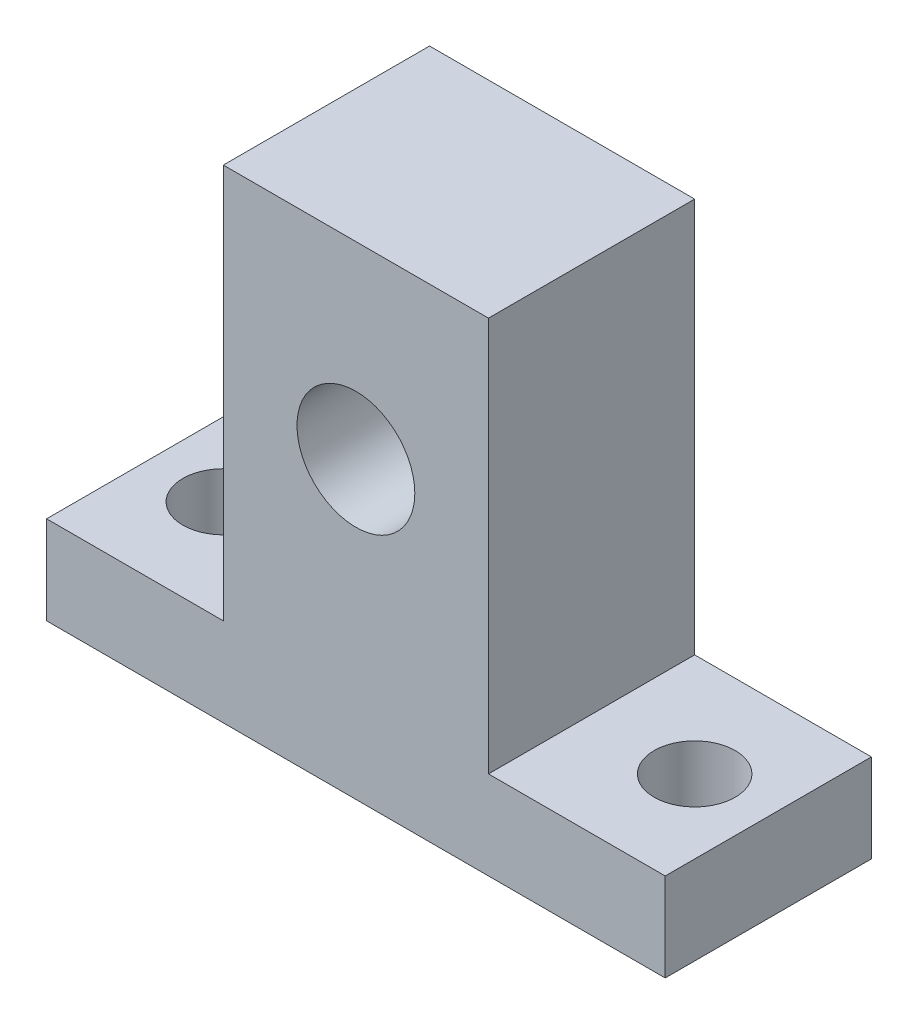
ISO-10303-21;
HEADER;
FILE_DESCRIPTION(('STEP AP214'),'2;1');
FILE_NAME('part.step','',(''),(''),'','','');
FILE_SCHEMA(('AUTOMOTIVE_DESIGN { 1 0 10303 214 1 1 1 1 }'));
ENDSEC;
DATA;
#1=APPLICATION_CONTEXT('core data for automotive mechanical design processes');
#2=APPLICATION_PROTOCOL_DEFINITION('international standard','automotive_design',2000,#1);
#3=PRODUCT_CONTEXT('',#1,'mechanical');
#4=PRODUCT('Part','Part','',(#3));
#5=PRODUCT_RELATED_PRODUCT_CATEGORY('part','',(#4));
#6=PRODUCT_DEFINITION_FORMATION('','',#4);
#7=PRODUCT_DEFINITION_CONTEXT('part definition',#1,'design');
#8=PRODUCT_DEFINITION('design','',#6,#7);
#9=PRODUCT_DEFINITION_SHAPE('','',#8);
#10=(LENGTH_UNIT() NAMED_UNIT(*) SI_UNIT(.MILLI.,.METRE.));
#11=(NAMED_UNIT(*) PLANE_ANGLE_UNIT() SI_UNIT($,.RADIAN.));
#12=(NAMED_UNIT(*) SI_UNIT($,.STERADIAN.) SOLID_ANGLE_UNIT());
#13=UNCERTAINTY_MEASURE_WITH_UNIT(LENGTH_MEASURE(1.E-05),#10,'distance_accuracy_value','');
#14=(GEOMETRIC_REPRESENTATION_CONTEXT(3) GLOBAL_UNCERTAINTY_ASSIGNED_CONTEXT((#13)) GLOBAL_UNIT_ASSIGNED_CONTEXT((#10,
#11,#12)) REPRESENTATION_CONTEXT('',''));
#15=CARTESIAN_POINT('',(0.,0.,0.));
#16=DIRECTION('',(0.,0.,1.));
#17=DIRECTION('',(1.,0.,0.));
#18=AXIS2_PLACEMENT_3D('',#15,#16,#17);
#19=CARTESIAN_POINT('',(0.,0.,14.));
#20=DIRECTION('',(0.,0.,-1.));
#21=DIRECTION('',(-1.,0.,0.));
#22=AXIS2_PLACEMENT_3D('',#19,#20,#21);
#23=PLANE('',#22);
#24=DIRECTION('',(0.,-1.,0.));
#25=VECTOR('',#24,1.);
#26=CARTESIAN_POINT('',(0.,0.,14.));
#27=LINE('',#26,#25);
#28=CARTESIAN_POINT('',(0.,6.,14.));
#29=VERTEX_POINT('',#28);
#30=CARTESIAN_POINT('',(0.,0.,14.));
#31=VERTEX_POINT('',#30);
#32=EDGE_CURVE('E144',#29,#31,#27,.T.);
#33=ORIENTED_EDGE('',*,*,#32,.T.);
#34=DIRECTION('',(1.,0.,0.));
#35=VECTOR('',#34,1.);
#36=CARTESIAN_POINT('',(0.,0.,14.));
#37=LINE('',#36,#35);
#38=CARTESIAN_POINT('',(42.,0.,14.));
#39=VERTEX_POINT('',#38);
#40=EDGE_CURVE('E92',#31,#39,#37,.T.);
#41=ORIENTED_EDGE('',*,*,#40,.T.);
#42=DIRECTION('',(0.,1.,0.));
#43=VECTOR('',#42,1.);
#44=CARTESIAN_POINT('',(42.,0.,14.));
#45=LINE('',#44,#43);
#46=CARTESIAN_POINT('',(42.,6.,14.));
#47=VERTEX_POINT('',#46);
#48=EDGE_CURVE('E159',#39,#47,#45,.T.);
#49=ORIENTED_EDGE('',*,*,#48,.T.);
#50=DIRECTION('',(-1.,0.,0.));
#51=VECTOR('',#50,1.);
#52=CARTESIAN_POINT('',(30.,6.,14.));
#53=LINE('',#52,#51);
#54=CARTESIAN_POINT('',(30.,6.,14.));
#55=VERTEX_POINT('',#54);
#56=EDGE_CURVE('E172',#47,#55,#53,.T.);
#57=ORIENTED_EDGE('',*,*,#56,.T.);
#58=DIRECTION('',(0.,1.,0.));
#59=VECTOR('',#58,1.);
#60=CARTESIAN_POINT('',(30.,6.,14.));
#61=LINE('',#60,#59);
#62=CARTESIAN_POINT('',(30.,32.8,14.));
#63=VERTEX_POINT('',#62);
#64=EDGE_CURVE('E111',#55,#63,#61,.T.);
#65=ORIENTED_EDGE('',*,*,#64,.T.);
#66=DIRECTION('',(-1.,0.,0.));
#67=VECTOR('',#66,1.);
#68=CARTESIAN_POINT('',(12.,32.8,14.));
#69=LINE('',#68,#67);
#70=CARTESIAN_POINT('',(12.,32.8,14.));
#71=VERTEX_POINT('',#70);
#72=EDGE_CURVE('E105',#63,#71,#69,.T.);
#73=ORIENTED_EDGE('',*,*,#72,.T.);
#74=DIRECTION('',(0.,-1.,0.));
#75=VECTOR('',#74,1.);
#76=CARTESIAN_POINT('',(12.,6.,14.));
#77=LINE('',#76,#75);
#78=CARTESIAN_POINT('',(12.,6.,14.));
#79=VERTEX_POINT('',#78);
#80=EDGE_CURVE('E109',#71,#79,#77,.T.);
#81=ORIENTED_EDGE('',*,*,#80,.T.);
#82=DIRECTION('',(-1.,0.,0.));
#83=VECTOR('',#82,1.);
#84=CARTESIAN_POINT('',(0.,6.,14.));
#85=LINE('',#84,#83);
#86=EDGE_CURVE('E49',#79,#29,#85,.T.);
#87=ORIENTED_EDGE('',*,*,#86,.T.);
#88=EDGE_LOOP('',(#33,#41,#49,#57,#65,#73,#81,#87));
#89=FACE_BOUND('',#88,.T.);
#90=CARTESIAN_POINT('',(21.,20.,14.));
#91=DIRECTION('',(0.,0.,1.));
#92=DIRECTION('',(1.,0.,0.));
#93=AXIS2_PLACEMENT_3D('',#90,#91,#92);
#94=CIRCLE('',#93,4.);
#95=CARTESIAN_POINT('',(25.,20.,14.));
#96=VERTEX_POINT('',#95);
#97=EDGE_CURVE('E133',#96,#96,#94,.T.);
#98=ORIENTED_EDGE('',*,*,#97,.F.);
#99=EDGE_LOOP('',(#98));
#100=FACE_BOUND('',#99,.T.);
#101=ADVANCED_FACE('F32',(#89,#100),#23,.F.);
#102=CARTESIAN_POINT('',(0.,0.,0.));
#103=DIRECTION('',(0.,0.,-1.));
#104=DIRECTION('',(-1.,0.,0.));
#105=AXIS2_PLACEMENT_3D('',#102,#103,#104);
#106=PLANE('',#105);
#107=DIRECTION('',(0.,-1.,0.));
#108=VECTOR('',#107,1.);
#109=CARTESIAN_POINT('',(0.,0.,0.));
#110=LINE('',#109,#108);
#111=CARTESIAN_POINT('',(0.,6.,0.));
#112=VERTEX_POINT('',#111);
#113=CARTESIAN_POINT('',(0.,0.,0.));
#114=VERTEX_POINT('',#113);
#115=EDGE_CURVE('E129',#112,#114,#110,.T.);
#116=ORIENTED_EDGE('',*,*,#115,.F.);
#117=DIRECTION('',(-1.,0.,0.));
#118=VECTOR('',#117,1.);
#119=CARTESIAN_POINT('',(0.,6.,0.));
#120=LINE('',#119,#118);
#121=CARTESIAN_POINT('',(12.,6.,0.));
#122=VERTEX_POINT('',#121);
#123=EDGE_CURVE('E84',#122,#112,#120,.T.);
#124=ORIENTED_EDGE('',*,*,#123,.F.);
#125=DIRECTION('',(0.,-1.,0.));
#126=VECTOR('',#125,1.);
#127=CARTESIAN_POINT('',(12.,6.,0.));
#128=LINE('',#127,#126);
#129=CARTESIAN_POINT('',(12.,32.8,0.));
#130=VERTEX_POINT('',#129);
#131=EDGE_CURVE('E78',#130,#122,#128,.T.);
#132=ORIENTED_EDGE('',*,*,#131,.F.);
#133=DIRECTION('',(-1.,0.,0.));
#134=VECTOR('',#133,1.);
#135=CARTESIAN_POINT('',(12.,32.8,0.));
#136=LINE('',#135,#134);
#137=CARTESIAN_POINT('',(30.,32.8,0.));
#138=VERTEX_POINT('',#137);
#139=EDGE_CURVE('E119',#138,#130,#136,.T.);
#140=ORIENTED_EDGE('',*,*,#139,.F.);
#141=DIRECTION('',(0.,1.,0.));
#142=VECTOR('',#141,1.);
#143=CARTESIAN_POINT('',(30.,6.,0.));
#144=LINE('',#143,#142);
#145=CARTESIAN_POINT('',(30.,6.,0.));
#146=VERTEX_POINT('',#145);
#147=EDGE_CURVE('E139',#146,#138,#144,.T.);
#148=ORIENTED_EDGE('',*,*,#147,.F.);
#149=DIRECTION('',(-1.,0.,0.));
#150=VECTOR('',#149,1.);
#151=CARTESIAN_POINT('',(30.,6.,0.));
#152=LINE('',#151,#150);
#153=CARTESIAN_POINT('',(42.,6.,0.));
#154=VERTEX_POINT('',#153);
#155=EDGE_CURVE('E137',#154,#146,#152,.T.);
#156=ORIENTED_EDGE('',*,*,#155,.F.);
#157=DIRECTION('',(0.,1.,0.));
#158=VECTOR('',#157,1.);
#159=CARTESIAN_POINT('',(42.,0.,0.));
#160=LINE('',#159,#158);
#161=CARTESIAN_POINT('',(42.,0.,0.));
#162=VERTEX_POINT('',#161);
#163=EDGE_CURVE('E135',#162,#154,#160,.T.);
#164=ORIENTED_EDGE('',*,*,#163,.F.);
#165=DIRECTION('',(1.,0.,0.));
#166=VECTOR('',#165,1.);
#167=CARTESIAN_POINT('',(0.,0.,0.));
#168=LINE('',#167,#166);
#169=EDGE_CURVE('E132',#114,#162,#168,.T.);
#170=ORIENTED_EDGE('',*,*,#169,.F.);
#171=EDGE_LOOP('',(#116,#124,#132,#140,#148,#156,#164,#170));
#172=FACE_BOUND('',#171,.T.);
#173=CARTESIAN_POINT('',(21.,20.,0.));
#174=DIRECTION('',(0.,0.,1.));
#175=DIRECTION('',(1.,0.,0.));
#176=AXIS2_PLACEMENT_3D('',#173,#174,#175);
#177=CIRCLE('',#176,4.);
#178=CARTESIAN_POINT('',(25.,20.,0.));
#179=VERTEX_POINT('',#178);
#180=EDGE_CURVE('E178',#179,#179,#177,.T.);
#181=ORIENTED_EDGE('',*,*,#180,.T.);
#182=EDGE_LOOP('',(#181));
#183=FACE_BOUND('',#182,.T.);
#184=ADVANCED_FACE('F163',(#172,#183),#106,.T.);
#185=CARTESIAN_POINT('',(0.,0.,14.));
#186=DIRECTION('',(1.,0.,0.));
#187=DIRECTION('',(0.,0.,-1.));
#188=AXIS2_PLACEMENT_3D('',#185,#186,#187);
#189=PLANE('',#188);
#190=ORIENTED_EDGE('',*,*,#115,.T.);
#191=DIRECTION('',(0.,0.,-1.));
#192=VECTOR('',#191,1.);
#193=CARTESIAN_POINT('',(0.,0.,14.));
#194=LINE('',#193,#192);
#195=EDGE_CURVE('E11',#31,#114,#194,.T.);
#196=ORIENTED_EDGE('',*,*,#195,.F.);
#197=ORIENTED_EDGE('',*,*,#32,.F.);
#198=DIRECTION('',(0.,0.,-1.));
#199=VECTOR('',#198,1.);
#200=CARTESIAN_POINT('',(0.,6.,14.));
#201=LINE('',#200,#199);
#202=EDGE_CURVE('E125',#29,#112,#201,.T.);
#203=ORIENTED_EDGE('',*,*,#202,.T.);
#204=EDGE_LOOP('',(#190,#196,#197,#203));
#205=FACE_BOUND('',#204,.T.);
#206=ADVANCED_FACE('F34',(#205),#189,.F.);
#207=CARTESIAN_POINT('',(0.,0.,14.));
#208=DIRECTION('',(0.,1.,0.));
#209=DIRECTION('',(0.,0.,1.));
#210=AXIS2_PLACEMENT_3D('',#207,#208,#209);
#211=PLANE('',#210);
#212=CARTESIAN_POINT('',(37.,0.,7.));
#213=DIRECTION('',(0.,1.,0.));
#214=DIRECTION('',(0.,0.,1.));
#215=AXIS2_PLACEMENT_3D('',#212,#213,#214);
#216=CIRCLE('',#215,2.75);
#217=CARTESIAN_POINT('',(37.,0.,9.75));
#218=VERTEX_POINT('',#217);
#219=EDGE_CURVE('E187',#218,#218,#216,.T.);
#220=ORIENTED_EDGE('',*,*,#219,.T.);
#221=EDGE_LOOP('',(#220));
#222=FACE_BOUND('',#221,.T.);
#223=CARTESIAN_POINT('',(5.,0.,7.));
#224=DIRECTION('',(0.,1.,0.));
#225=DIRECTION('',(0.,0.,1.));
#226=AXIS2_PLACEMENT_3D('',#223,#224,#225);
#227=CIRCLE('',#226,2.75);
#228=CARTESIAN_POINT('',(5.,0.,9.75));
#229=VERTEX_POINT('',#228);
#230=EDGE_CURVE('E181',#229,#229,#227,.T.);
#231=ORIENTED_EDGE('',*,*,#230,.T.);
#232=EDGE_LOOP('',(#231));
#233=FACE_BOUND('',#232,.T.);
#234=ORIENTED_EDGE('',*,*,#169,.T.);
#235=DIRECTION('',(0.,0.,-1.));
#236=VECTOR('',#235,1.);
#237=CARTESIAN_POINT('',(42.,0.,14.));
#238=LINE('',#237,#236);
#239=EDGE_CURVE('E41',#39,#162,#238,.T.);
#240=ORIENTED_EDGE('',*,*,#239,.F.);
#241=ORIENTED_EDGE('',*,*,#40,.F.);
#242=ORIENTED_EDGE('',*,*,#195,.T.);
#243=EDGE_LOOP('',(#234,#240,#241,#242));
#244=FACE_BOUND('',#243,.T.);
#245=ADVANCED_FACE('F196',(#222,#233,#244),#211,.F.);
#246=CARTESIAN_POINT('',(42.,0.,14.));
#247=DIRECTION('',(-1.,0.,0.));
#248=DIRECTION('',(0.,0.,1.));
#249=AXIS2_PLACEMENT_3D('',#246,#247,#248);
#250=PLANE('',#249);
#251=ORIENTED_EDGE('',*,*,#163,.T.);
#252=DIRECTION('',(0.,0.,-1.));
#253=VECTOR('',#252,1.);
#254=CARTESIAN_POINT('',(42.,6.,14.));
#255=LINE('',#254,#253);
#256=EDGE_CURVE('E151',#47,#154,#255,.T.);
#257=ORIENTED_EDGE('',*,*,#256,.F.);
#258=ORIENTED_EDGE('',*,*,#48,.F.);
#259=ORIENTED_EDGE('',*,*,#239,.T.);
#260=EDGE_LOOP('',(#251,#257,#258,#259));
#261=FACE_BOUND('',#260,.T.);
#262=ADVANCED_FACE('F157',(#261),#250,.F.);
#263=CARTESIAN_POINT('',(30.,6.,14.));
#264=DIRECTION('',(0.,-1.,0.));
#265=DIRECTION('',(0.,0.,-1.));
#266=AXIS2_PLACEMENT_3D('',#263,#264,#265);
#267=PLANE('',#266);
#268=CARTESIAN_POINT('',(37.,6.,7.));
#269=DIRECTION('',(0.,1.,0.));
#270=DIRECTION('',(0.,0.,1.));
#271=AXIS2_PLACEMENT_3D('',#268,#269,#270);
#272=CIRCLE('',#271,2.75);
#273=CARTESIAN_POINT('',(37.,6.,9.75));
#274=VERTEX_POINT('',#273);
#275=EDGE_CURVE('E190',#274,#274,#272,.T.);
#276=ORIENTED_EDGE('',*,*,#275,.F.);
#277=EDGE_LOOP('',(#276));
#278=FACE_BOUND('',#277,.T.);
#279=ORIENTED_EDGE('',*,*,#155,.T.);
#280=DIRECTION('',(0.,0.,-1.));
#281=VECTOR('',#280,1.);
#282=CARTESIAN_POINT('',(30.,6.,14.));
#283=LINE('',#282,#281);
#284=EDGE_CURVE('E148',#55,#146,#283,.T.);
#285=ORIENTED_EDGE('',*,*,#284,.F.);
#286=ORIENTED_EDGE('',*,*,#56,.F.);
#287=ORIENTED_EDGE('',*,*,#256,.T.);
#288=EDGE_LOOP('',(#279,#285,#286,#287));
#289=FACE_BOUND('',#288,.T.);
#290=ADVANCED_FACE('F168',(#278,#289),#267,.F.);
#291=CARTESIAN_POINT('',(30.,6.,14.));
#292=DIRECTION('',(-1.,0.,0.));
#293=DIRECTION('',(0.,0.,1.));
#294=AXIS2_PLACEMENT_3D('',#291,#292,#293);
#295=PLANE('',#294);
#296=ORIENTED_EDGE('',*,*,#147,.T.);
#297=DIRECTION('',(0.,0.,-1.));
#298=VECTOR('',#297,1.);
#299=CARTESIAN_POINT('',(30.,32.8,14.));
#300=LINE('',#299,#298);
#301=EDGE_CURVE('E120',#63,#138,#300,.T.);
#302=ORIENTED_EDGE('',*,*,#301,.F.);
#303=ORIENTED_EDGE('',*,*,#64,.F.);
#304=ORIENTED_EDGE('',*,*,#284,.T.);
#305=EDGE_LOOP('',(#296,#302,#303,#304));
#306=FACE_BOUND('',#305,.T.);
#307=ADVANCED_FACE('F171',(#306),#295,.F.);
#308=CARTESIAN_POINT('',(12.,32.8,14.));
#309=DIRECTION('',(0.,-1.,0.));
#310=DIRECTION('',(0.,0.,-1.));
#311=AXIS2_PLACEMENT_3D('',#308,#309,#310);
#312=PLANE('',#311);
#313=ORIENTED_EDGE('',*,*,#139,.T.);
#314=DIRECTION('',(0.,0.,-1.));
#315=VECTOR('',#314,1.);
#316=CARTESIAN_POINT('',(12.,32.8,14.));
#317=LINE('',#316,#315);
#318=EDGE_CURVE('E116',#71,#130,#317,.T.);
#319=ORIENTED_EDGE('',*,*,#318,.F.);
#320=ORIENTED_EDGE('',*,*,#72,.F.);
#321=ORIENTED_EDGE('',*,*,#301,.T.);
#322=EDGE_LOOP('',(#313,#319,#320,#321));
#323=FACE_BOUND('',#322,.T.);
#324=ADVANCED_FACE('F117',(#323),#312,.F.);
#325=CARTESIAN_POINT('',(12.,6.,14.));
#326=DIRECTION('',(1.,0.,0.));
#327=DIRECTION('',(0.,0.,-1.));
#328=AXIS2_PLACEMENT_3D('',#325,#326,#327);
#329=PLANE('',#328);
#330=ORIENTED_EDGE('',*,*,#131,.T.);
#331=DIRECTION('',(0.,0.,-1.));
#332=VECTOR('',#331,1.);
#333=CARTESIAN_POINT('',(12.,6.,14.));
#334=LINE('',#333,#332);
#335=EDGE_CURVE('E121',#79,#122,#334,.T.);
#336=ORIENTED_EDGE('',*,*,#335,.F.);
#337=ORIENTED_EDGE('',*,*,#80,.F.);
#338=ORIENTED_EDGE('',*,*,#318,.T.);
#339=EDGE_LOOP('',(#330,#336,#337,#338));
#340=FACE_BOUND('',#339,.T.);
#341=ADVANCED_FACE('F123',(#340),#329,.F.);
#342=CARTESIAN_POINT('',(0.,6.,14.));
#343=DIRECTION('',(0.,-1.,0.));
#344=DIRECTION('',(0.,0.,-1.));
#345=AXIS2_PLACEMENT_3D('',#342,#343,#344);
#346=PLANE('',#345);
#347=CARTESIAN_POINT('',(5.,6.,7.));
#348=DIRECTION('',(0.,1.,0.));
#349=DIRECTION('',(0.,0.,1.));
#350=AXIS2_PLACEMENT_3D('',#347,#348,#349);
#351=CIRCLE('',#350,2.75);
#352=CARTESIAN_POINT('',(5.,6.,9.75));
#353=VERTEX_POINT('',#352);
#354=EDGE_CURVE('E184',#353,#353,#351,.T.);
#355=ORIENTED_EDGE('',*,*,#354,.F.);
#356=EDGE_LOOP('',(#355));
#357=FACE_BOUND('',#356,.T.);
#358=ORIENTED_EDGE('',*,*,#123,.T.);
#359=ORIENTED_EDGE('',*,*,#202,.F.);
#360=ORIENTED_EDGE('',*,*,#86,.F.);
#361=ORIENTED_EDGE('',*,*,#335,.T.);
#362=EDGE_LOOP('',(#358,#359,#360,#361));
#363=FACE_BOUND('',#362,.T.);
#364=ADVANCED_FACE('F224',(#357,#363),#346,.F.);
#365=CARTESIAN_POINT('',(21.,20.,14.));
#366=DIRECTION('',(0.,0.,-1.));
#367=DIRECTION('',(-1.,0.,0.));
#368=AXIS2_PLACEMENT_3D('',#365,#366,#367);
#369=CYLINDRICAL_SURFACE('',#368,4.);
#370=ORIENTED_EDGE('',*,*,#97,.T.);
#371=EDGE_LOOP('',(#370));
#372=FACE_BOUND('',#371,.T.);
#373=ORIENTED_EDGE('',*,*,#180,.F.);
#374=EDGE_LOOP('',(#373));
#375=FACE_BOUND('',#374,.T.);
#376=ADVANCED_FACE('F221',(#372,#375),#369,.F.);
#377=CARTESIAN_POINT('',(5.,0.,7.));
#378=DIRECTION('',(0.,1.,0.));
#379=DIRECTION('',(0.,0.,1.));
#380=AXIS2_PLACEMENT_3D('',#377,#378,#379);
#381=CYLINDRICAL_SURFACE('',#380,2.75);
#382=ORIENTED_EDGE('',*,*,#230,.F.);
#383=EDGE_LOOP('',(#382));
#384=FACE_BOUND('',#383,.T.);
#385=ORIENTED_EDGE('',*,*,#354,.T.);
#386=EDGE_LOOP('',(#385));
#387=FACE_BOUND('',#386,.T.);
#388=ADVANCED_FACE('F202',(#384,#387),#381,.F.);
#389=CARTESIAN_POINT('',(37.,0.,7.));
#390=DIRECTION('',(0.,1.,0.));
#391=DIRECTION('',(0.,0.,1.));
#392=AXIS2_PLACEMENT_3D('',#389,#390,#391);
#393=CYLINDRICAL_SURFACE('',#392,2.75);
#394=ORIENTED_EDGE('',*,*,#219,.F.);
#395=EDGE_LOOP('',(#394));
#396=FACE_BOUND('',#395,.T.);
#397=ORIENTED_EDGE('',*,*,#275,.T.);
#398=EDGE_LOOP('',(#397));
#399=FACE_BOUND('',#398,.T.);
#400=ADVANCED_FACE('F199',(#396,#399),#393,.F.);
#401=CLOSED_SHELL('',(#101,#184,#206,#245,#262,#290,#307,#324,#341,#364,#376,#388,#400));
#402=MANIFOLD_SOLID_BREP('B2',#401);
#403=ADVANCED_BREP_SHAPE_REPRESENTATION('',(#18,#402),#14);
#404=SHAPE_DEFINITION_REPRESENTATION(#9,#403);
ENDSEC;
END-ISO-10303-21;
